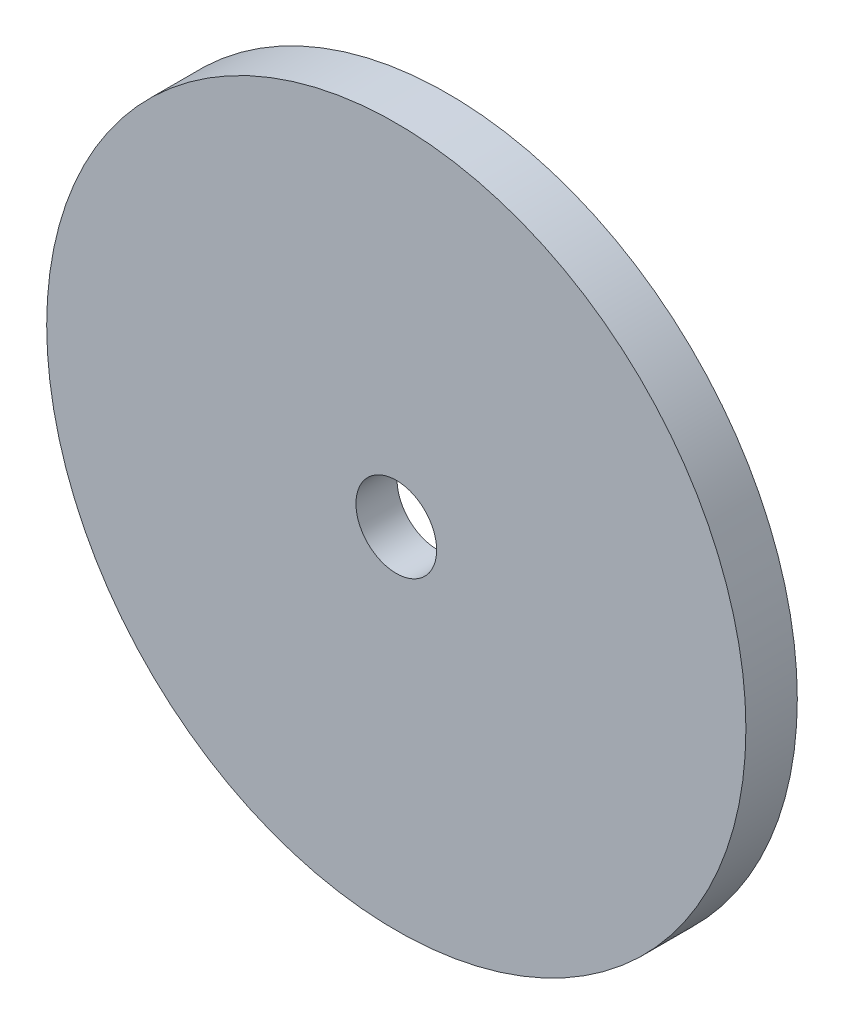
ISO-10303-21;
HEADER;
FILE_DESCRIPTION(('STEP AP214'),'2;1');
FILE_NAME('part.step','',(''),(''),'','','');
FILE_SCHEMA(('AUTOMOTIVE_DESIGN { 1 0 10303 214 1 1 1 1 }'));
ENDSEC;
DATA;
#1=APPLICATION_CONTEXT('core data for automotive mechanical design processes');
#2=APPLICATION_PROTOCOL_DEFINITION('international standard','automotive_design',2000,#1);
#3=PRODUCT_CONTEXT('',#1,'mechanical');
#4=PRODUCT('Part','Part','',(#3));
#5=PRODUCT_RELATED_PRODUCT_CATEGORY('part','',(#4));
#6=PRODUCT_DEFINITION_FORMATION('','',#4);
#7=PRODUCT_DEFINITION_CONTEXT('part definition',#1,'design');
#8=PRODUCT_DEFINITION('design','',#6,#7);
#9=PRODUCT_DEFINITION_SHAPE('','',#8);
#10=(LENGTH_UNIT() NAMED_UNIT(*) SI_UNIT(.MILLI.,.METRE.));
#11=(NAMED_UNIT(*) PLANE_ANGLE_UNIT() SI_UNIT($,.RADIAN.));
#12=(NAMED_UNIT(*) SI_UNIT($,.STERADIAN.) SOLID_ANGLE_UNIT());
#13=UNCERTAINTY_MEASURE_WITH_UNIT(LENGTH_MEASURE(1.E-05),#10,'distance_accuracy_value','');
#14=(GEOMETRIC_REPRESENTATION_CONTEXT(3) GLOBAL_UNCERTAINTY_ASSIGNED_CONTEXT((#13)) GLOBAL_UNIT_ASSIGNED_CONTEXT((#10,
#11,#12)) REPRESENTATION_CONTEXT('',''));
#15=CARTESIAN_POINT('',(0.,0.,0.));
#16=DIRECTION('',(0.,0.,1.));
#17=DIRECTION('',(1.,0.,0.));
#18=AXIS2_PLACEMENT_3D('',#15,#16,#17);
#19=CARTESIAN_POINT('',(9.62,10.,-1.));
#20=DIRECTION('',(0.,0.,1.));
#21=DIRECTION('',(1.,0.,0.));
#22=AXIS2_PLACEMENT_3D('',#19,#20,#21);
#23=CYLINDRICAL_SURFACE('',#22,34.);
#24=CARTESIAN_POINT('',(9.62,10.,-1.));
#25=DIRECTION('',(0.,0.,1.));
#26=DIRECTION('',(1.,0.,0.));
#27=AXIS2_PLACEMENT_3D('',#24,#25,#26);
#28=CIRCLE('',#27,34.);
#29=CARTESIAN_POINT('',(43.62,10.,-1.));
#30=VERTEX_POINT('',#29);
#31=EDGE_CURVE('E10',#30,#30,#28,.T.);
#32=ORIENTED_EDGE('',*,*,#31,.T.);
#33=EDGE_LOOP('',(#32));
#34=FACE_BOUND('',#33,.T.);
#35=CARTESIAN_POINT('',(9.62,10.,4.));
#36=DIRECTION('',(0.,0.,1.));
#37=DIRECTION('',(1.,0.,0.));
#38=AXIS2_PLACEMENT_3D('',#35,#36,#37);
#39=CIRCLE('',#38,34.);
#40=CARTESIAN_POINT('',(43.62,10.,4.));
#41=VERTEX_POINT('',#40);
#42=EDGE_CURVE('E46',#41,#41,#39,.T.);
#43=ORIENTED_EDGE('',*,*,#42,.F.);
#44=EDGE_LOOP('',(#43));
#45=FACE_BOUND('',#44,.T.);
#46=ADVANCED_FACE('F31',(#34,#45),#23,.T.);
#47=CARTESIAN_POINT('',(9.62,10.,-1.));
#48=DIRECTION('',(0.,0.,1.));
#49=DIRECTION('',(1.,0.,0.));
#50=AXIS2_PLACEMENT_3D('',#47,#48,#49);
#51=PLANE('',#50);
#52=CARTESIAN_POINT('',(9.62,10.,-1.));
#53=DIRECTION('',(0.,0.,1.));
#54=DIRECTION('',(1.,0.,0.));
#55=AXIS2_PLACEMENT_3D('',#52,#53,#54);
#56=CIRCLE('',#55,10.9);
#57=CARTESIAN_POINT('',(20.52,10.,-1.));
#58=VERTEX_POINT('',#57);
#59=EDGE_CURVE('E37',#58,#58,#56,.T.);
#60=ORIENTED_EDGE('',*,*,#59,.T.);
#61=EDGE_LOOP('',(#60));
#62=FACE_BOUND('',#61,.T.);
#63=ORIENTED_EDGE('',*,*,#31,.F.);
#64=EDGE_LOOP('',(#63));
#65=FACE_BOUND('',#64,.T.);
#66=ADVANCED_FACE('F74',(#62,#65),#51,.F.);
#67=CARTESIAN_POINT('',(9.62,10.,-1.));
#68=DIRECTION('',(0.,0.,1.));
#69=DIRECTION('',(1.,0.,0.));
#70=AXIS2_PLACEMENT_3D('',#67,#68,#69);
#71=CYLINDRICAL_SURFACE('',#70,10.9);
#72=ORIENTED_EDGE('',*,*,#59,.F.);
#73=EDGE_LOOP('',(#72));
#74=FACE_BOUND('',#73,.T.);
#75=CARTESIAN_POINT('',(9.62,10.,0.));
#76=DIRECTION('',(0.,0.,1.));
#77=DIRECTION('',(1.,0.,0.));
#78=AXIS2_PLACEMENT_3D('',#75,#76,#77);
#79=CIRCLE('',#78,10.9);
#80=CARTESIAN_POINT('',(20.52,10.,0.));
#81=VERTEX_POINT('',#80);
#82=EDGE_CURVE('E41',#81,#81,#79,.T.);
#83=ORIENTED_EDGE('',*,*,#82,.T.);
#84=EDGE_LOOP('',(#83));
#85=FACE_BOUND('',#84,.T.);
#86=ADVANCED_FACE('F70',(#74,#85),#71,.F.);
#87=CARTESIAN_POINT('',(9.62,10.,0.));
#88=DIRECTION('',(0.,0.,1.));
#89=DIRECTION('',(1.,0.,0.));
#90=AXIS2_PLACEMENT_3D('',#87,#88,#89);
#91=PLANE('',#90);
#92=CARTESIAN_POINT('',(9.62,10.,0.));
#93=DIRECTION('',(0.,0.,1.));
#94=DIRECTION('',(1.,0.,0.));
#95=AXIS2_PLACEMENT_3D('',#92,#93,#94);
#96=CIRCLE('',#95,3.925);
#97=CARTESIAN_POINT('',(13.545,10.,0.));
#98=VERTEX_POINT('',#97);
#99=EDGE_CURVE('E51',#98,#98,#96,.T.);
#100=ORIENTED_EDGE('',*,*,#99,.T.);
#101=EDGE_LOOP('',(#100));
#102=FACE_BOUND('',#101,.T.);
#103=ORIENTED_EDGE('',*,*,#82,.F.);
#104=EDGE_LOOP('',(#103));
#105=FACE_BOUND('',#104,.T.);
#106=ADVANCED_FACE('F62',(#102,#105),#91,.F.);
#107=CARTESIAN_POINT('',(9.62,10.,4.));
#108=DIRECTION('',(0.,0.,1.));
#109=DIRECTION('',(1.,0.,0.));
#110=AXIS2_PLACEMENT_3D('',#107,#108,#109);
#111=PLANE('',#110);
#112=ORIENTED_EDGE('',*,*,#42,.T.);
#113=EDGE_LOOP('',(#112));
#114=FACE_BOUND('',#113,.T.);
#115=CARTESIAN_POINT('',(9.62,10.,4.));
#116=DIRECTION('',(0.,0.,1.));
#117=DIRECTION('',(1.,0.,0.));
#118=AXIS2_PLACEMENT_3D('',#115,#116,#117);
#119=CIRCLE('',#118,3.925);
#120=CARTESIAN_POINT('',(13.545,10.,4.));
#121=VERTEX_POINT('',#120);
#122=EDGE_CURVE('E50',#121,#121,#119,.T.);
#123=ORIENTED_EDGE('',*,*,#122,.F.);
#124=EDGE_LOOP('',(#123));
#125=FACE_BOUND('',#124,.T.);
#126=ADVANCED_FACE('F60',(#114,#125),#111,.T.);
#127=CARTESIAN_POINT('',(9.62,10.,4.));
#128=DIRECTION('',(0.,0.,-1.));
#129=DIRECTION('',(-1.,0.,0.));
#130=AXIS2_PLACEMENT_3D('',#127,#128,#129);
#131=CYLINDRICAL_SURFACE('',#130,3.925);
#132=ORIENTED_EDGE('',*,*,#122,.T.);
#133=EDGE_LOOP('',(#132));
#134=FACE_BOUND('',#133,.T.);
#135=ORIENTED_EDGE('',*,*,#99,.F.);
#136=EDGE_LOOP('',(#135));
#137=FACE_BOUND('',#136,.T.);
#138=ADVANCED_FACE('F57',(#134,#137),#131,.F.);
#139=CLOSED_SHELL('',(#46,#66,#86,#106,#126,#138));
#140=MANIFOLD_SOLID_BREP('B2',#139);
#141=ADVANCED_BREP_SHAPE_REPRESENTATION('',(#18,#140),#14);
#142=SHAPE_DEFINITION_REPRESENTATION(#9,#141);
ENDSEC;
END-ISO-10303-21;
